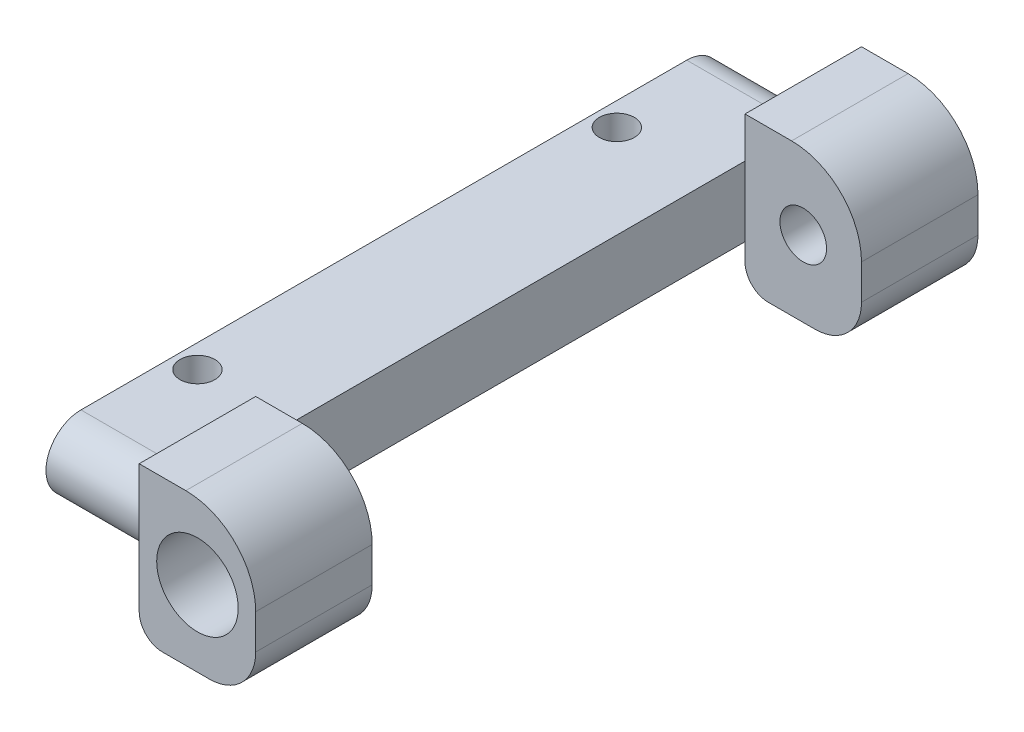
ISO-10303-21;
HEADER;
FILE_DESCRIPTION(('STEP AP214'),'2;1');
FILE_NAME('part.step','',(''),(''),'','','');
FILE_SCHEMA(('AUTOMOTIVE_DESIGN { 1 0 10303 214 1 1 1 1 }'));
ENDSEC;
DATA;
#1=APPLICATION_CONTEXT('core data for automotive mechanical design processes');
#2=APPLICATION_PROTOCOL_DEFINITION('international standard','automotive_design',2000,#1);
#3=PRODUCT_CONTEXT('',#1,'mechanical');
#4=PRODUCT('Part','Part','',(#3));
#5=PRODUCT_RELATED_PRODUCT_CATEGORY('part','',(#4));
#6=PRODUCT_DEFINITION_FORMATION('','',#4);
#7=PRODUCT_DEFINITION_CONTEXT('part definition',#1,'design');
#8=PRODUCT_DEFINITION('design','',#6,#7);
#9=PRODUCT_DEFINITION_SHAPE('','',#8);
#10=(LENGTH_UNIT() NAMED_UNIT(*) SI_UNIT(.MILLI.,.METRE.));
#11=(NAMED_UNIT(*) PLANE_ANGLE_UNIT() SI_UNIT($,.RADIAN.));
#12=(NAMED_UNIT(*) SI_UNIT($,.STERADIAN.) SOLID_ANGLE_UNIT());
#13=UNCERTAINTY_MEASURE_WITH_UNIT(LENGTH_MEASURE(1.E-05),#10,'distance_accuracy_value','');
#14=(GEOMETRIC_REPRESENTATION_CONTEXT(3) GLOBAL_UNCERTAINTY_ASSIGNED_CONTEXT((#13)) GLOBAL_UNIT_ASSIGNED_CONTEXT((#10,
#11,#12)) REPRESENTATION_CONTEXT('',''));
#15=CARTESIAN_POINT('',(0.,0.,0.));
#16=DIRECTION('',(0.,0.,1.));
#17=DIRECTION('',(1.,0.,0.));
#18=AXIS2_PLACEMENT_3D('',#15,#16,#17);
#19=CARTESIAN_POINT('',(10.,3.25,10.5));
#20=DIRECTION('',(0.,0.,1.));
#21=DIRECTION('',(1.,0.,0.));
#22=AXIS2_PLACEMENT_3D('',#19,#20,#21);
#23=PLANE('',#22);
#24=DIRECTION('',(-1.,0.,0.));
#25=VECTOR('',#24,1.);
#26=CARTESIAN_POINT('',(10.,-3.25,10.5));
#27=LINE('',#26,#25);
#28=CARTESIAN_POINT('',(8.,-3.25,10.5));
#29=VERTEX_POINT('',#28);
#30=CARTESIAN_POINT('',(6.,-3.25,10.5));
#31=VERTEX_POINT('',#30);
#32=EDGE_CURVE('E207',#29,#31,#27,.T.);
#33=ORIENTED_EDGE('',*,*,#32,.T.);
#34=CARTESIAN_POINT('',(6.,-2.25,10.5));
#35=DIRECTION('',(0.,0.,1.));
#36=DIRECTION('',(1.,0.,0.));
#37=AXIS2_PLACEMENT_3D('',#34,#35,#36);
#38=CIRCLE('',#37,1.);
#39=CARTESIAN_POINT('',(5.,-2.25,10.5));
#40=VERTEX_POINT('',#39);
#41=EDGE_CURVE('E302',#31,#40,#38,.F.);
#42=ORIENTED_EDGE('',*,*,#41,.T.);
#43=DIRECTION('',(0.,1.,0.));
#44=VECTOR('',#43,1.);
#45=CARTESIAN_POINT('',(5.,3.25,10.5));
#46=LINE('',#45,#44);
#47=CARTESIAN_POINT('',(5.,-1.5,10.5));
#48=VERTEX_POINT('',#47);
#49=EDGE_CURVE('E208',#40,#48,#46,.T.);
#50=ORIENTED_EDGE('',*,*,#49,.T.);
#51=CARTESIAN_POINT('',(5.,1.5,10.5));
#52=VERTEX_POINT('',#51);
#53=EDGE_CURVE('E211',#48,#52,#46,.T.);
#54=ORIENTED_EDGE('',*,*,#53,.T.);
#55=CARTESIAN_POINT('',(5.,3.25,10.5));
#56=VERTEX_POINT('',#55);
#57=EDGE_CURVE('E182',#52,#56,#46,.T.);
#58=ORIENTED_EDGE('',*,*,#57,.T.);
#59=DIRECTION('',(-1.,0.,0.));
#60=VECTOR('',#59,1.);
#61=CARTESIAN_POINT('',(10.,3.25,10.5));
#62=LINE('',#61,#60);
#63=CARTESIAN_POINT('',(7.,3.25,10.5));
#64=VERTEX_POINT('',#63);
#65=EDGE_CURVE('E223',#64,#56,#62,.T.);
#66=ORIENTED_EDGE('',*,*,#65,.F.);
#67=CARTESIAN_POINT('',(7.,0.25,10.5));
#68=DIRECTION('',(0.,0.,1.));
#69=DIRECTION('',(1.,0.,0.));
#70=AXIS2_PLACEMENT_3D('',#67,#68,#69);
#71=CIRCLE('',#70,3.);
#72=CARTESIAN_POINT('',(10.,0.25,10.5));
#73=VERTEX_POINT('',#72);
#74=EDGE_CURVE('E270',#64,#73,#71,.F.);
#75=ORIENTED_EDGE('',*,*,#74,.T.);
#76=DIRECTION('',(0.,1.,0.));
#77=VECTOR('',#76,1.);
#78=CARTESIAN_POINT('',(10.,3.25,10.5));
#79=LINE('',#78,#77);
#80=CARTESIAN_POINT('',(10.,-1.25,10.5));
#81=VERTEX_POINT('',#80);
#82=EDGE_CURVE('E201',#81,#73,#79,.T.);
#83=ORIENTED_EDGE('',*,*,#82,.F.);
#84=CARTESIAN_POINT('',(8.,-1.25,10.5));
#85=DIRECTION('',(0.,0.,1.));
#86=DIRECTION('',(1.,0.,0.));
#87=AXIS2_PLACEMENT_3D('',#84,#85,#86);
#88=CIRCLE('',#87,2.);
#89=EDGE_CURVE('E293',#81,#29,#88,.F.);
#90=ORIENTED_EDGE('',*,*,#89,.T.);
#91=EDGE_LOOP('',(#33,#42,#50,#54,#58,#66,#75,#83,#90));
#92=FACE_BOUND('',#91,.T.);
#93=CARTESIAN_POINT('',(7.5,0.,10.5));
#94=DIRECTION('',(0.,0.,-1.));
#95=DIRECTION('',(-1.,0.,0.));
#96=AXIS2_PLACEMENT_3D('',#93,#94,#95);
#97=CIRCLE('',#96,1.);
#98=CARTESIAN_POINT('',(6.5,0.,10.5));
#99=VERTEX_POINT('',#98);
#100=EDGE_CURVE('E347',#99,#99,#97,.T.);
#101=ORIENTED_EDGE('',*,*,#100,.F.);
#102=EDGE_LOOP('',(#101));
#103=FACE_BOUND('',#102,.T.);
#104=ADVANCED_FACE('F32',(#92,#103),#23,.F.);
#105=CARTESIAN_POINT('',(7.5,0.,13.));
#106=DIRECTION('',(0.,0.,1.));
#107=DIRECTION('',(-1.,0.,0.));
#108=AXIS2_PLACEMENT_3D('',#105,#106,#107);
#109=PLANE('',#108);
#110=CARTESIAN_POINT('',(7.5,0.,13.));
#111=DIRECTION('',(0.,0.,-1.));
#112=DIRECTION('',(-1.,0.,0.));
#113=AXIS2_PLACEMENT_3D('',#110,#111,#112);
#114=CIRCLE('',#113,1.75);
#115=CARTESIAN_POINT('',(5.75,0.,13.));
#116=VERTEX_POINT('',#115);
#117=EDGE_CURVE('E341',#116,#116,#114,.T.);
#118=ORIENTED_EDGE('',*,*,#117,.F.);
#119=EDGE_LOOP('',(#118));
#120=FACE_BOUND('',#119,.T.);
#121=CARTESIAN_POINT('',(7.5,0.,13.));
#122=DIRECTION('',(0.,0.,-1.));
#123=DIRECTION('',(-1.,0.,0.));
#124=AXIS2_PLACEMENT_3D('',#121,#122,#123);
#125=CIRCLE('',#124,1.);
#126=CARTESIAN_POINT('',(6.5,0.,13.));
#127=VERTEX_POINT('',#126);
#128=EDGE_CURVE('E350',#127,#127,#125,.T.);
#129=ORIENTED_EDGE('',*,*,#128,.T.);
#130=EDGE_LOOP('',(#129));
#131=FACE_BOUND('',#130,.T.);
#132=ADVANCED_FACE('F421',(#120,#131),#109,.T.);
#133=CARTESIAN_POINT('',(10.,3.25,15.5));
#134=DIRECTION('',(0.,0.,-1.));
#135=DIRECTION('',(-1.,0.,0.));
#136=AXIS2_PLACEMENT_3D('',#133,#134,#135);
#137=PLANE('',#136);
#138=DIRECTION('',(0.,-1.,0.));
#139=VECTOR('',#138,1.);
#140=CARTESIAN_POINT('',(5.,3.25,15.5));
#141=LINE('',#140,#139);
#142=CARTESIAN_POINT('',(5.,3.25,15.5));
#143=VERTEX_POINT('',#142);
#144=CARTESIAN_POINT('',(5.,-2.25,15.5));
#145=VERTEX_POINT('',#144);
#146=EDGE_CURVE('E204',#143,#145,#141,.T.);
#147=ORIENTED_EDGE('',*,*,#146,.T.);
#148=CARTESIAN_POINT('',(6.,-2.25,15.5));
#149=DIRECTION('',(0.,0.,-1.));
#150=DIRECTION('',(-1.,0.,0.));
#151=AXIS2_PLACEMENT_3D('',#148,#149,#150);
#152=CIRCLE('',#151,1.);
#153=CARTESIAN_POINT('',(6.,-3.25,15.5));
#154=VERTEX_POINT('',#153);
#155=EDGE_CURVE('E306',#145,#154,#152,.F.);
#156=ORIENTED_EDGE('',*,*,#155,.T.);
#157=DIRECTION('',(-1.,0.,0.));
#158=VECTOR('',#157,1.);
#159=CARTESIAN_POINT('',(10.,-3.25,15.5));
#160=LINE('',#159,#158);
#161=CARTESIAN_POINT('',(8.,-3.25,15.5));
#162=VERTEX_POINT('',#161);
#163=EDGE_CURVE('E218',#162,#154,#160,.T.);
#164=ORIENTED_EDGE('',*,*,#163,.F.);
#165=CARTESIAN_POINT('',(8.,-1.25,15.5));
#166=DIRECTION('',(0.,0.,-1.));
#167=DIRECTION('',(-1.,0.,0.));
#168=AXIS2_PLACEMENT_3D('',#165,#166,#167);
#169=CIRCLE('',#168,2.);
#170=CARTESIAN_POINT('',(10.,-1.25,15.5));
#171=VERTEX_POINT('',#170);
#172=EDGE_CURVE('E297',#162,#171,#169,.F.);
#173=ORIENTED_EDGE('',*,*,#172,.T.);
#174=DIRECTION('',(0.,-1.,0.));
#175=VECTOR('',#174,1.);
#176=CARTESIAN_POINT('',(10.,3.25,15.5));
#177=LINE('',#176,#175);
#178=CARTESIAN_POINT('',(10.,0.25,15.5));
#179=VERTEX_POINT('',#178);
#180=EDGE_CURVE('E203',#179,#171,#177,.T.);
#181=ORIENTED_EDGE('',*,*,#180,.F.);
#182=CARTESIAN_POINT('',(7.,0.25,15.5));
#183=DIRECTION('',(0.,0.,-1.));
#184=DIRECTION('',(-1.,0.,0.));
#185=AXIS2_PLACEMENT_3D('',#182,#183,#184);
#186=CIRCLE('',#185,3.);
#187=CARTESIAN_POINT('',(7.,3.25,15.5));
#188=VERTEX_POINT('',#187);
#189=EDGE_CURVE('E266',#179,#188,#186,.F.);
#190=ORIENTED_EDGE('',*,*,#189,.T.);
#191=DIRECTION('',(-1.,0.,0.));
#192=VECTOR('',#191,1.);
#193=CARTESIAN_POINT('',(10.,3.25,15.5));
#194=LINE('',#193,#192);
#195=EDGE_CURVE('E221',#188,#143,#194,.T.);
#196=ORIENTED_EDGE('',*,*,#195,.T.);
#197=EDGE_LOOP('',(#147,#156,#164,#173,#181,#190,#196));
#198=FACE_BOUND('',#197,.T.);
#199=CARTESIAN_POINT('',(7.5,0.,15.5));
#200=DIRECTION('',(0.,0.,-1.));
#201=DIRECTION('',(-1.,0.,0.));
#202=AXIS2_PLACEMENT_3D('',#199,#200,#201);
#203=CIRCLE('',#202,1.75);
#204=CARTESIAN_POINT('',(5.75,0.,15.5));
#205=VERTEX_POINT('',#204);
#206=EDGE_CURVE('E344',#205,#205,#203,.T.);
#207=ORIENTED_EDGE('',*,*,#206,.T.);
#208=EDGE_LOOP('',(#207));
#209=FACE_BOUND('',#208,.T.);
#210=ADVANCED_FACE('F427',(#198,#209),#137,.F.);
#211=CARTESIAN_POINT('',(5.,0.,13.));
#212=DIRECTION('',(1.,0.,0.));
#213=DIRECTION('',(0.,0.,-1.));
#214=AXIS2_PLACEMENT_3D('',#211,#212,#213);
#215=PLANE('',#214);
#216=DIRECTION('',(0.,0.,-1.));
#217=VECTOR('',#216,1.);
#218=CARTESIAN_POINT('',(5.,-1.5,13.));
#219=LINE('',#218,#217);
#220=CARTESIAN_POINT('',(5.,-1.5,-10.5));
#221=VERTEX_POINT('',#220);
#222=EDGE_CURVE('E235',#48,#221,#219,.T.);
#223=ORIENTED_EDGE('',*,*,#222,.T.);
#224=DIRECTION('',(0.,1.,0.));
#225=VECTOR('',#224,1.);
#226=CARTESIAN_POINT('',(5.,0.,-10.5));
#227=LINE('',#226,#225);
#228=CARTESIAN_POINT('',(5.,1.50000000000001,-10.5));
#229=VERTEX_POINT('',#228);
#230=EDGE_CURVE('E260',#221,#229,#227,.T.);
#231=ORIENTED_EDGE('',*,*,#230,.T.);
#232=DIRECTION('',(0.,0.,1.));
#233=VECTOR('',#232,1.);
#234=CARTESIAN_POINT('',(5.,1.5,13.));
#235=LINE('',#234,#233);
#236=EDGE_CURVE('E241',#229,#52,#235,.T.);
#237=ORIENTED_EDGE('',*,*,#236,.T.);
#238=ORIENTED_EDGE('',*,*,#53,.F.);
#239=EDGE_LOOP('',(#223,#231,#237,#238));
#240=FACE_BOUND('',#239,.T.);
#241=ADVANCED_FACE('F406',(#240),#215,.T.);
#242=CARTESIAN_POINT('',(5.,0.,13.));
#243=DIRECTION('',(-1.,0.,0.));
#244=DIRECTION('',(0.,0.,1.));
#245=AXIS2_PLACEMENT_3D('',#242,#243,#244);
#246=CYLINDRICAL_SURFACE('',#245,1.5);
#247=CARTESIAN_POINT('',(0.,0.,13.));
#248=DIRECTION('',(1.,0.,0.));
#249=DIRECTION('',(0.,0.,-1.));
#250=AXIS2_PLACEMENT_3D('',#247,#248,#249);
#251=CIRCLE('',#250,1.5);
#252=CARTESIAN_POINT('',(0.,1.5,13.));
#253=VERTEX_POINT('',#252);
#254=CARTESIAN_POINT('',(0.,-1.5,13.));
#255=VERTEX_POINT('',#254);
#256=EDGE_CURVE('E225',#253,#255,#251,.T.);
#257=ORIENTED_EDGE('',*,*,#256,.T.);
#258=DIRECTION('',(-1.,0.,0.));
#259=VECTOR('',#258,1.);
#260=CARTESIAN_POINT('',(5.,-1.5,13.));
#261=LINE('',#260,#259);
#262=CARTESIAN_POINT('',(5.,-1.5,13.));
#263=VERTEX_POINT('',#262);
#264=EDGE_CURVE('E257',#263,#255,#261,.T.);
#265=ORIENTED_EDGE('',*,*,#264,.F.);
#266=CARTESIAN_POINT('',(5.,0.,13.));
#267=DIRECTION('',(1.,0.,0.));
#268=DIRECTION('',(0.,0.,-1.));
#269=AXIS2_PLACEMENT_3D('',#266,#267,#268);
#270=CIRCLE('',#269,1.5);
#271=CARTESIAN_POINT('',(5.,1.5,13.));
#272=VERTEX_POINT('',#271);
#273=EDGE_CURVE('E226',#272,#263,#270,.T.);
#274=ORIENTED_EDGE('',*,*,#273,.F.);
#275=DIRECTION('',(-1.,0.,0.));
#276=VECTOR('',#275,1.);
#277=CARTESIAN_POINT('',(5.,1.5,13.));
#278=LINE('',#277,#276);
#279=EDGE_CURVE('E240',#272,#253,#278,.T.);
#280=ORIENTED_EDGE('',*,*,#279,.T.);
#281=EDGE_LOOP('',(#257,#265,#274,#280));
#282=FACE_BOUND('',#281,.T.);
#283=ADVANCED_FACE('F388',(#282),#246,.T.);
#284=CARTESIAN_POINT('',(5.,-1.5,13.));
#285=DIRECTION('',(0.,1.,0.));
#286=DIRECTION('',(0.,0.,1.));
#287=AXIS2_PLACEMENT_3D('',#284,#285,#286);
#288=PLANE('',#287);
#289=CARTESIAN_POINT('',(1.,-1.5,8.99999999999999));
#290=DIRECTION('',(0.,1.,0.));
#291=DIRECTION('',(0.,0.,1.));
#292=AXIS2_PLACEMENT_3D('',#289,#290,#291);
#293=CIRCLE('',#292,0.75);
#294=CARTESIAN_POINT('',(1.,-1.5,9.74999999999999));
#295=VERTEX_POINT('',#294);
#296=EDGE_CURVE('E361',#295,#295,#293,.T.);
#297=ORIENTED_EDGE('',*,*,#296,.T.);
#298=EDGE_LOOP('',(#297));
#299=FACE_BOUND('',#298,.T.);
#300=CARTESIAN_POINT('',(1.,-1.5,-9.));
#301=DIRECTION('',(0.,1.,0.));
#302=DIRECTION('',(0.,0.,1.));
#303=AXIS2_PLACEMENT_3D('',#300,#301,#302);
#304=CIRCLE('',#303,0.75);
#305=CARTESIAN_POINT('',(1.,-1.5,-8.25));
#306=VERTEX_POINT('',#305);
#307=EDGE_CURVE('E353',#306,#306,#304,.T.);
#308=ORIENTED_EDGE('',*,*,#307,.T.);
#309=EDGE_LOOP('',(#308));
#310=FACE_BOUND('',#309,.T.);
#311=DIRECTION('',(0.,0.,-1.));
#312=VECTOR('',#311,1.);
#313=CARTESIAN_POINT('',(0.,-1.5,13.));
#314=LINE('',#313,#312);
#315=CARTESIAN_POINT('',(0.,-1.5,-13.));
#316=VERTEX_POINT('',#315);
#317=EDGE_CURVE('E244',#255,#316,#314,.T.);
#318=ORIENTED_EDGE('',*,*,#317,.T.);
#319=DIRECTION('',(-1.,0.,0.));
#320=VECTOR('',#319,1.);
#321=CARTESIAN_POINT('',(5.,-1.5,-13.));
#322=LINE('',#321,#320);
#323=CARTESIAN_POINT('',(5.,-1.5,-13.));
#324=VERTEX_POINT('',#323);
#325=EDGE_CURVE('E254',#324,#316,#322,.T.);
#326=ORIENTED_EDGE('',*,*,#325,.F.);
#327=EDGE_CURVE('E229',#221,#324,#219,.T.);
#328=ORIENTED_EDGE('',*,*,#327,.F.);
#329=ORIENTED_EDGE('',*,*,#222,.F.);
#330=EDGE_CURVE('E231',#263,#48,#219,.T.);
#331=ORIENTED_EDGE('',*,*,#330,.F.);
#332=ORIENTED_EDGE('',*,*,#264,.T.);
#333=EDGE_LOOP('',(#318,#326,#328,#329,#331,#332));
#334=FACE_BOUND('',#333,.T.);
#335=ADVANCED_FACE('F393',(#299,#310,#334),#288,.F.);
#336=CARTESIAN_POINT('',(5.,0.,-13.));
#337=DIRECTION('',(-1.,0.,0.));
#338=DIRECTION('',(0.,0.,1.));
#339=AXIS2_PLACEMENT_3D('',#336,#337,#338);
#340=CYLINDRICAL_SURFACE('',#339,1.5);
#341=CARTESIAN_POINT('',(0.,0.,-13.));
#342=DIRECTION('',(1.,0.,0.));
#343=DIRECTION('',(0.,0.,-1.));
#344=AXIS2_PLACEMENT_3D('',#341,#342,#343);
#345=CIRCLE('',#344,1.5);
#346=CARTESIAN_POINT('',(0.,1.50000000000001,-13.));
#347=VERTEX_POINT('',#346);
#348=EDGE_CURVE('E246',#316,#347,#345,.T.);
#349=ORIENTED_EDGE('',*,*,#348,.T.);
#350=DIRECTION('',(-1.,0.,0.));
#351=VECTOR('',#350,1.);
#352=CARTESIAN_POINT('',(5.,1.50000000000001,-13.));
#353=LINE('',#352,#351);
#354=CARTESIAN_POINT('',(5.,1.50000000000001,-13.));
#355=VERTEX_POINT('',#354);
#356=EDGE_CURVE('E251',#355,#347,#353,.T.);
#357=ORIENTED_EDGE('',*,*,#356,.F.);
#358=CARTESIAN_POINT('',(5.,0.,-13.));
#359=DIRECTION('',(1.,0.,0.));
#360=DIRECTION('',(0.,0.,-1.));
#361=AXIS2_PLACEMENT_3D('',#358,#359,#360);
#362=CIRCLE('',#361,1.5);
#363=EDGE_CURVE('E234',#324,#355,#362,.T.);
#364=ORIENTED_EDGE('',*,*,#363,.F.);
#365=ORIENTED_EDGE('',*,*,#325,.T.);
#366=EDGE_LOOP('',(#349,#357,#364,#365));
#367=FACE_BOUND('',#366,.T.);
#368=ADVANCED_FACE('F375',(#367),#340,.T.);
#369=CARTESIAN_POINT('',(5.,1.5,13.));
#370=DIRECTION('',(0.,-1.,0.));
#371=DIRECTION('',(0.,0.,-1.));
#372=AXIS2_PLACEMENT_3D('',#369,#370,#371);
#373=PLANE('',#372);
#374=CARTESIAN_POINT('',(1.,1.5,8.99999999999999));
#375=DIRECTION('',(0.,1.,0.));
#376=DIRECTION('',(0.,0.,-1.));
#377=AXIS2_PLACEMENT_3D('',#374,#375,#376);
#378=CIRCLE('',#377,0.75);
#379=CARTESIAN_POINT('',(1.,1.5,8.24999999999999));
#380=VERTEX_POINT('',#379);
#381=EDGE_CURVE('E364',#380,#380,#378,.T.);
#382=ORIENTED_EDGE('',*,*,#381,.F.);
#383=EDGE_LOOP('',(#382));
#384=FACE_BOUND('',#383,.T.);
#385=CARTESIAN_POINT('',(1.,1.50000000000001,-9.));
#386=DIRECTION('',(0.,1.,0.));
#387=DIRECTION('',(0.,0.,1.));
#388=AXIS2_PLACEMENT_3D('',#385,#386,#387);
#389=CIRCLE('',#388,0.75);
#390=CARTESIAN_POINT('',(1.,1.50000000000001,-8.25));
#391=VERTEX_POINT('',#390);
#392=EDGE_CURVE('E358',#391,#391,#389,.T.);
#393=ORIENTED_EDGE('',*,*,#392,.F.);
#394=EDGE_LOOP('',(#393));
#395=FACE_BOUND('',#394,.T.);
#396=DIRECTION('',(0.,0.,1.));
#397=VECTOR('',#396,1.);
#398=CARTESIAN_POINT('',(0.,1.5,13.));
#399=LINE('',#398,#397);
#400=EDGE_CURVE('E230',#347,#253,#399,.T.);
#401=ORIENTED_EDGE('',*,*,#400,.T.);
#402=ORIENTED_EDGE('',*,*,#279,.F.);
#403=EDGE_CURVE('E237',#52,#272,#235,.T.);
#404=ORIENTED_EDGE('',*,*,#403,.F.);
#405=ORIENTED_EDGE('',*,*,#236,.F.);
#406=EDGE_CURVE('E238',#355,#229,#235,.T.);
#407=ORIENTED_EDGE('',*,*,#406,.F.);
#408=ORIENTED_EDGE('',*,*,#356,.T.);
#409=EDGE_LOOP('',(#401,#402,#404,#405,#407,#408));
#410=FACE_BOUND('',#409,.T.);
#411=ADVANCED_FACE('F371',(#384,#395,#410),#373,.F.);
#412=CARTESIAN_POINT('',(0.,0.,13.));
#413=DIRECTION('',(1.,0.,0.));
#414=DIRECTION('',(0.,0.,-1.));
#415=AXIS2_PLACEMENT_3D('',#412,#413,#414);
#416=PLANE('',#415);
#417=ORIENTED_EDGE('',*,*,#256,.F.);
#418=ORIENTED_EDGE('',*,*,#400,.F.);
#419=ORIENTED_EDGE('',*,*,#348,.F.);
#420=ORIENTED_EDGE('',*,*,#317,.F.);
#421=EDGE_LOOP('',(#417,#418,#419,#420));
#422=FACE_BOUND('',#421,.T.);
#423=ADVANCED_FACE('F374',(#422),#416,.F.);
#424=CARTESIAN_POINT('',(5.,0.,0.));
#425=DIRECTION('',(1.,0.,0.));
#426=DIRECTION('',(0.,0.,-1.));
#427=AXIS2_PLACEMENT_3D('',#424,#425,#426);
#428=PLANE('',#427);
#429=ORIENTED_EDGE('',*,*,#49,.F.);
#430=DIRECTION('',(0.,0.,-1.));
#431=VECTOR('',#430,1.);
#432=CARTESIAN_POINT('',(5.,-2.25,0.));
#433=LINE('',#432,#431);
#434=EDGE_CURVE('E304',#40,#145,#433,.F.);
#435=ORIENTED_EDGE('',*,*,#434,.T.);
#436=ORIENTED_EDGE('',*,*,#146,.F.);
#437=DIRECTION('',(0.,0.,1.));
#438=VECTOR('',#437,1.);
#439=CARTESIAN_POINT('',(5.,3.25,15.5));
#440=LINE('',#439,#438);
#441=EDGE_CURVE('E210',#56,#143,#440,.T.);
#442=ORIENTED_EDGE('',*,*,#441,.F.);
#443=ORIENTED_EDGE('',*,*,#57,.F.);
#444=ORIENTED_EDGE('',*,*,#403,.T.);
#445=ORIENTED_EDGE('',*,*,#273,.T.);
#446=ORIENTED_EDGE('',*,*,#330,.T.);
#447=EDGE_LOOP('',(#429,#435,#436,#442,#443,#444,#445,#446));
#448=FACE_BOUND('',#447,.T.);
#449=ADVANCED_FACE('F397',(#448),#428,.F.);
#450=CARTESIAN_POINT('',(10.,3.25,15.5));
#451=DIRECTION('',(0.,-1.,0.));
#452=DIRECTION('',(0.,0.,-1.));
#453=AXIS2_PLACEMENT_3D('',#450,#451,#452);
#454=PLANE('',#453);
#455=ORIENTED_EDGE('',*,*,#195,.F.);
#456=DIRECTION('',(0.,0.,1.));
#457=VECTOR('',#456,1.);
#458=CARTESIAN_POINT('',(7.,3.25,10.5));
#459=LINE('',#458,#457);
#460=EDGE_CURVE('E268',#188,#64,#459,.F.);
#461=ORIENTED_EDGE('',*,*,#460,.T.);
#462=ORIENTED_EDGE('',*,*,#65,.T.);
#463=ORIENTED_EDGE('',*,*,#441,.T.);
#464=EDGE_LOOP('',(#455,#461,#462,#463));
#465=FACE_BOUND('',#464,.T.);
#466=ADVANCED_FACE('F433',(#465),#454,.F.);
#467=CARTESIAN_POINT('',(10.,-3.25,15.5));
#468=DIRECTION('',(0.,1.,0.));
#469=DIRECTION('',(0.,0.,1.));
#470=AXIS2_PLACEMENT_3D('',#467,#468,#469);
#471=PLANE('',#470);
#472=ORIENTED_EDGE('',*,*,#163,.T.);
#473=DIRECTION('',(0.,0.,-1.));
#474=VECTOR('',#473,1.);
#475=CARTESIAN_POINT('',(6.,-3.25,15.5));
#476=LINE('',#475,#474);
#477=EDGE_CURVE('E299',#154,#31,#476,.T.);
#478=ORIENTED_EDGE('',*,*,#477,.T.);
#479=ORIENTED_EDGE('',*,*,#32,.F.);
#480=DIRECTION('',(0.,0.,-1.));
#481=VECTOR('',#480,1.);
#482=CARTESIAN_POINT('',(8.,-3.25,15.5));
#483=LINE('',#482,#481);
#484=EDGE_CURVE('E295',#29,#162,#483,.F.);
#485=ORIENTED_EDGE('',*,*,#484,.T.);
#486=EDGE_LOOP('',(#472,#478,#479,#485));
#487=FACE_BOUND('',#486,.T.);
#488=ADVANCED_FACE('F445',(#487),#471,.F.);
#489=CARTESIAN_POINT('',(10.,0.,0.));
#490=DIRECTION('',(1.,0.,0.));
#491=DIRECTION('',(0.,0.,-1.));
#492=AXIS2_PLACEMENT_3D('',#489,#490,#491);
#493=PLANE('',#492);
#494=ORIENTED_EDGE('',*,*,#180,.T.);
#495=DIRECTION('',(0.,0.,-1.));
#496=VECTOR('',#495,1.);
#497=CARTESIAN_POINT('',(10.,-1.25,10.5));
#498=LINE('',#497,#496);
#499=EDGE_CURVE('E290',#171,#81,#498,.T.);
#500=ORIENTED_EDGE('',*,*,#499,.T.);
#501=ORIENTED_EDGE('',*,*,#82,.T.);
#502=DIRECTION('',(0.,0.,1.));
#503=VECTOR('',#502,1.);
#504=CARTESIAN_POINT('',(10.,0.25,15.5));
#505=LINE('',#504,#503);
#506=EDGE_CURVE('E263',#73,#179,#505,.T.);
#507=ORIENTED_EDGE('',*,*,#506,.T.);
#508=EDGE_LOOP('',(#494,#500,#501,#507));
#509=FACE_BOUND('',#508,.T.);
#510=ADVANCED_FACE('F449',(#509),#493,.T.);
#511=CARTESIAN_POINT('',(5.,0.,0.));
#512=DIRECTION('',(-1.,0.,0.));
#513=DIRECTION('',(0.,0.,1.));
#514=AXIS2_PLACEMENT_3D('',#511,#512,#513);
#515=PLANE('',#514);
#516=DIRECTION('',(0.,1.,0.));
#517=VECTOR('',#516,1.);
#518=CARTESIAN_POINT('',(5.,3.25,-15.5));
#519=LINE('',#518,#517);
#520=CARTESIAN_POINT('',(5.,-2.25,-15.5));
#521=VERTEX_POINT('',#520);
#522=CARTESIAN_POINT('',(5.,3.25,-15.5));
#523=VERTEX_POINT('',#522);
#524=EDGE_CURVE('E165',#521,#523,#519,.T.);
#525=ORIENTED_EDGE('',*,*,#524,.F.);
#526=DIRECTION('',(0.,0.,-1.));
#527=VECTOR('',#526,1.);
#528=CARTESIAN_POINT('',(5.,-2.25,-10.5));
#529=LINE('',#528,#527);
#530=CARTESIAN_POINT('',(5.,-2.25,-10.5));
#531=VERTEX_POINT('',#530);
#532=EDGE_CURVE('E40',#521,#531,#529,.F.);
#533=ORIENTED_EDGE('',*,*,#532,.T.);
#534=DIRECTION('',(0.,-1.,0.));
#535=VECTOR('',#534,1.);
#536=CARTESIAN_POINT('',(5.,3.25,-10.5));
#537=LINE('',#536,#535);
#538=EDGE_CURVE('E188',#221,#531,#537,.T.);
#539=ORIENTED_EDGE('',*,*,#538,.F.);
#540=ORIENTED_EDGE('',*,*,#327,.T.);
#541=ORIENTED_EDGE('',*,*,#363,.T.);
#542=ORIENTED_EDGE('',*,*,#406,.T.);
#543=CARTESIAN_POINT('',(5.,3.25,-10.5));
#544=VERTEX_POINT('',#543);
#545=EDGE_CURVE('E187',#544,#229,#537,.T.);
#546=ORIENTED_EDGE('',*,*,#545,.F.);
#547=DIRECTION('',(0.,0.,1.));
#548=VECTOR('',#547,1.);
#549=CARTESIAN_POINT('',(5.,3.25,-15.5));
#550=LINE('',#549,#548);
#551=EDGE_CURVE('E172',#523,#544,#550,.T.);
#552=ORIENTED_EDGE('',*,*,#551,.F.);
#553=EDGE_LOOP('',(#525,#533,#539,#540,#541,#542,#546,#552));
#554=FACE_BOUND('',#553,.T.);
#555=ADVANCED_FACE('F185',(#554),#515,.T.);
#556=CARTESIAN_POINT('',(10.,3.25,-15.5));
#557=DIRECTION('',(0.,0.,1.));
#558=DIRECTION('',(1.,0.,0.));
#559=AXIS2_PLACEMENT_3D('',#556,#557,#558);
#560=PLANE('',#559);
#561=CARTESIAN_POINT('',(7.5,0.,-15.5));
#562=DIRECTION('',(0.,0.,-1.));
#563=DIRECTION('',(-1.,0.,0.));
#564=AXIS2_PLACEMENT_3D('',#561,#562,#563);
#565=CIRCLE('',#564,1.75);
#566=CARTESIAN_POINT('',(5.75,0.,-15.5));
#567=VERTEX_POINT('',#566);
#568=EDGE_CURVE('E332',#567,#567,#565,.T.);
#569=ORIENTED_EDGE('',*,*,#568,.F.);
#570=EDGE_LOOP('',(#569));
#571=FACE_BOUND('',#570,.T.);
#572=DIRECTION('',(-1.,0.,0.));
#573=VECTOR('',#572,1.);
#574=CARTESIAN_POINT('',(10.,-3.25,-15.5));
#575=LINE('',#574,#573);
#576=CARTESIAN_POINT('',(8.,-3.25,-15.5));
#577=VERTEX_POINT('',#576);
#578=CARTESIAN_POINT('',(6.,-3.25,-15.5));
#579=VERTEX_POINT('',#578);
#580=EDGE_CURVE('E194',#577,#579,#575,.T.);
#581=ORIENTED_EDGE('',*,*,#580,.T.);
#582=CARTESIAN_POINT('',(6.,-2.25,-15.5));
#583=DIRECTION('',(0.,0.,1.));
#584=DIRECTION('',(1.,0.,0.));
#585=AXIS2_PLACEMENT_3D('',#582,#583,#584);
#586=CIRCLE('',#585,1.);
#587=EDGE_CURVE('E54',#579,#521,#586,.F.);
#588=ORIENTED_EDGE('',*,*,#587,.T.);
#589=ORIENTED_EDGE('',*,*,#524,.T.);
#590=DIRECTION('',(-1.,0.,0.));
#591=VECTOR('',#590,1.);
#592=CARTESIAN_POINT('',(10.,3.25,-15.5));
#593=LINE('',#592,#591);
#594=CARTESIAN_POINT('',(7.,3.25,-15.5));
#595=VERTEX_POINT('',#594);
#596=EDGE_CURVE('E169',#595,#523,#593,.T.);
#597=ORIENTED_EDGE('',*,*,#596,.F.);
#598=CARTESIAN_POINT('',(7.,0.25,-15.5));
#599=DIRECTION('',(0.,0.,1.));
#600=DIRECTION('',(1.,0.,0.));
#601=AXIS2_PLACEMENT_3D('',#598,#599,#600);
#602=CIRCLE('',#601,3.);
#603=CARTESIAN_POINT('',(10.,0.25,-15.5));
#604=VERTEX_POINT('',#603);
#605=EDGE_CURVE('E279',#595,#604,#602,.F.);
#606=ORIENTED_EDGE('',*,*,#605,.T.);
#607=DIRECTION('',(0.,1.,0.));
#608=VECTOR('',#607,1.);
#609=CARTESIAN_POINT('',(10.,3.25,-15.5));
#610=LINE('',#609,#608);
#611=CARTESIAN_POINT('',(10.,-1.25,-15.5));
#612=VERTEX_POINT('',#611);
#613=EDGE_CURVE('E193',#612,#604,#610,.T.);
#614=ORIENTED_EDGE('',*,*,#613,.F.);
#615=CARTESIAN_POINT('',(8.,-1.25,-15.5));
#616=DIRECTION('',(0.,0.,1.));
#617=DIRECTION('',(1.,0.,0.));
#618=AXIS2_PLACEMENT_3D('',#615,#616,#617);
#619=CIRCLE('',#618,2.);
#620=EDGE_CURVE('E284',#612,#577,#619,.F.);
#621=ORIENTED_EDGE('',*,*,#620,.T.);
#622=EDGE_LOOP('',(#581,#588,#589,#597,#606,#614,#621));
#623=FACE_BOUND('',#622,.T.);
#624=ADVANCED_FACE('F167',(#571,#623),#560,.F.);
#625=CARTESIAN_POINT('',(10.,3.25,-15.5));
#626=DIRECTION('',(0.,-1.,0.));
#627=DIRECTION('',(0.,0.,-1.));
#628=AXIS2_PLACEMENT_3D('',#625,#626,#627);
#629=PLANE('',#628);
#630=DIRECTION('',(-1.,0.,0.));
#631=VECTOR('',#630,1.);
#632=CARTESIAN_POINT('',(10.,3.25,-10.5));
#633=LINE('',#632,#631);
#634=CARTESIAN_POINT('',(7.,3.25,-10.5));
#635=VERTEX_POINT('',#634);
#636=EDGE_CURVE('E183',#635,#544,#633,.T.);
#637=ORIENTED_EDGE('',*,*,#636,.F.);
#638=DIRECTION('',(0.,0.,1.));
#639=VECTOR('',#638,1.);
#640=CARTESIAN_POINT('',(7.,3.25,-15.5));
#641=LINE('',#640,#639);
#642=EDGE_CURVE('E181',#635,#595,#641,.F.);
#643=ORIENTED_EDGE('',*,*,#642,.T.);
#644=ORIENTED_EDGE('',*,*,#596,.T.);
#645=ORIENTED_EDGE('',*,*,#551,.T.);
#646=EDGE_LOOP('',(#637,#643,#644,#645));
#647=FACE_BOUND('',#646,.T.);
#648=ADVANCED_FACE('F178',(#647),#629,.F.);
#649=CARTESIAN_POINT('',(10.,3.25,-10.5));
#650=DIRECTION('',(0.,0.,-1.));
#651=DIRECTION('',(-1.,0.,0.));
#652=AXIS2_PLACEMENT_3D('',#649,#650,#651);
#653=PLANE('',#652);
#654=CARTESIAN_POINT('',(7.5,0.,-10.5));
#655=DIRECTION('',(0.,0.,-1.));
#656=DIRECTION('',(-1.,0.,0.));
#657=AXIS2_PLACEMENT_3D('',#654,#655,#656);
#658=CIRCLE('',#657,1.);
#659=CARTESIAN_POINT('',(6.5,0.,-10.5));
#660=VERTEX_POINT('',#659);
#661=EDGE_CURVE('E335',#660,#660,#658,.T.);
#662=ORIENTED_EDGE('',*,*,#661,.T.);
#663=EDGE_LOOP('',(#662));
#664=FACE_BOUND('',#663,.T.);
#665=ORIENTED_EDGE('',*,*,#538,.T.);
#666=CARTESIAN_POINT('',(6.,-2.25,-10.5));
#667=DIRECTION('',(0.,0.,-1.));
#668=DIRECTION('',(-1.,0.,0.));
#669=AXIS2_PLACEMENT_3D('',#666,#667,#668);
#670=CIRCLE('',#669,1.);
#671=CARTESIAN_POINT('',(6.,-3.25,-10.5));
#672=VERTEX_POINT('',#671);
#673=EDGE_CURVE('E11',#531,#672,#670,.F.);
#674=ORIENTED_EDGE('',*,*,#673,.T.);
#675=DIRECTION('',(-1.,0.,0.));
#676=VECTOR('',#675,1.);
#677=CARTESIAN_POINT('',(10.,-3.25,-10.5));
#678=LINE('',#677,#676);
#679=CARTESIAN_POINT('',(8.,-3.25,-10.5));
#680=VERTEX_POINT('',#679);
#681=EDGE_CURVE('E196',#680,#672,#678,.T.);
#682=ORIENTED_EDGE('',*,*,#681,.F.);
#683=CARTESIAN_POINT('',(8.,-1.25,-10.5));
#684=DIRECTION('',(0.,0.,-1.));
#685=DIRECTION('',(-1.,0.,0.));
#686=AXIS2_PLACEMENT_3D('',#683,#684,#685);
#687=CIRCLE('',#686,2.);
#688=CARTESIAN_POINT('',(10.,-1.25,-10.5));
#689=VERTEX_POINT('',#688);
#690=EDGE_CURVE('E288',#680,#689,#687,.F.);
#691=ORIENTED_EDGE('',*,*,#690,.T.);
#692=DIRECTION('',(0.,-1.,0.));
#693=VECTOR('',#692,1.);
#694=CARTESIAN_POINT('',(10.,3.25,-10.5));
#695=LINE('',#694,#693);
#696=CARTESIAN_POINT('',(10.,0.25,-10.5));
#697=VERTEX_POINT('',#696);
#698=EDGE_CURVE('E197',#697,#689,#695,.T.);
#699=ORIENTED_EDGE('',*,*,#698,.F.);
#700=CARTESIAN_POINT('',(7.,0.25,-10.5));
#701=DIRECTION('',(0.,0.,-1.));
#702=DIRECTION('',(-1.,0.,0.));
#703=AXIS2_PLACEMENT_3D('',#700,#701,#702);
#704=CIRCLE('',#703,3.);
#705=EDGE_CURVE('E276',#697,#635,#704,.F.);
#706=ORIENTED_EDGE('',*,*,#705,.T.);
#707=ORIENTED_EDGE('',*,*,#636,.T.);
#708=ORIENTED_EDGE('',*,*,#545,.T.);
#709=ORIENTED_EDGE('',*,*,#230,.F.);
#710=EDGE_LOOP('',(#665,#674,#682,#691,#699,#706,#707,#708,#709));
#711=FACE_BOUND('',#710,.T.);
#712=ADVANCED_FACE('F493',(#664,#711),#653,.F.);
#713=CARTESIAN_POINT('',(10.,-3.25,-15.5));
#714=DIRECTION('',(0.,1.,0.));
#715=DIRECTION('',(0.,0.,1.));
#716=AXIS2_PLACEMENT_3D('',#713,#714,#715);
#717=PLANE('',#716);
#718=ORIENTED_EDGE('',*,*,#681,.T.);
#719=DIRECTION('',(0.,0.,-1.));
#720=VECTOR('',#719,1.);
#721=CARTESIAN_POINT('',(6.,-3.25,-15.5));
#722=LINE('',#721,#720);
#723=EDGE_CURVE('E308',#672,#579,#722,.T.);
#724=ORIENTED_EDGE('',*,*,#723,.T.);
#725=ORIENTED_EDGE('',*,*,#580,.F.);
#726=DIRECTION('',(0.,0.,-1.));
#727=VECTOR('',#726,1.);
#728=CARTESIAN_POINT('',(8.,-3.25,-15.5));
#729=LINE('',#728,#727);
#730=EDGE_CURVE('E286',#577,#680,#729,.F.);
#731=ORIENTED_EDGE('',*,*,#730,.T.);
#732=EDGE_LOOP('',(#718,#724,#725,#731));
#733=FACE_BOUND('',#732,.T.);
#734=ADVANCED_FACE('F314',(#733),#717,.F.);
#735=CARTESIAN_POINT('',(10.,0.,0.));
#736=DIRECTION('',(-1.,0.,0.));
#737=DIRECTION('',(0.,0.,1.));
#738=AXIS2_PLACEMENT_3D('',#735,#736,#737);
#739=PLANE('',#738);
#740=ORIENTED_EDGE('',*,*,#698,.T.);
#741=DIRECTION('',(0.,0.,-1.));
#742=VECTOR('',#741,1.);
#743=CARTESIAN_POINT('',(10.,-1.25,0.));
#744=LINE('',#743,#742);
#745=EDGE_CURVE('E281',#689,#612,#744,.T.);
#746=ORIENTED_EDGE('',*,*,#745,.T.);
#747=ORIENTED_EDGE('',*,*,#613,.T.);
#748=DIRECTION('',(0.,0.,1.));
#749=VECTOR('',#748,1.);
#750=CARTESIAN_POINT('',(10.,0.25,0.));
#751=LINE('',#750,#749);
#752=EDGE_CURVE('E273',#604,#697,#751,.T.);
#753=ORIENTED_EDGE('',*,*,#752,.T.);
#754=EDGE_LOOP('',(#740,#746,#747,#753));
#755=FACE_BOUND('',#754,.T.);
#756=ADVANCED_FACE('F326',(#755),#739,.F.);
#757=CARTESIAN_POINT('',(7.,0.25,0.));
#758=DIRECTION('',(0.,0.,-1.));
#759=DIRECTION('',(-1.,0.,0.));
#760=AXIS2_PLACEMENT_3D('',#757,#758,#759);
#761=CYLINDRICAL_SURFACE('',#760,3.);
#762=ORIENTED_EDGE('',*,*,#74,.F.);
#763=ORIENTED_EDGE('',*,*,#460,.F.);
#764=ORIENTED_EDGE('',*,*,#189,.F.);
#765=ORIENTED_EDGE('',*,*,#506,.F.);
#766=EDGE_LOOP('',(#762,#763,#764,#765));
#767=FACE_BOUND('',#766,.T.);
#768=ADVANCED_FACE('F488',(#767),#761,.T.);
#769=CARTESIAN_POINT('',(7.,0.25,0.));
#770=DIRECTION('',(0.,0.,1.));
#771=DIRECTION('',(1.,0.,0.));
#772=AXIS2_PLACEMENT_3D('',#769,#770,#771);
#773=CYLINDRICAL_SURFACE('',#772,3.);
#774=ORIENTED_EDGE('',*,*,#605,.F.);
#775=ORIENTED_EDGE('',*,*,#642,.F.);
#776=ORIENTED_EDGE('',*,*,#705,.F.);
#777=ORIENTED_EDGE('',*,*,#752,.F.);
#778=EDGE_LOOP('',(#774,#775,#776,#777));
#779=FACE_BOUND('',#778,.T.);
#780=ADVANCED_FACE('F536',(#779),#773,.T.);
#781=CARTESIAN_POINT('',(8.,-1.25,0.));
#782=DIRECTION('',(0.,0.,-1.));
#783=DIRECTION('',(-1.,0.,0.));
#784=AXIS2_PLACEMENT_3D('',#781,#782,#783);
#785=CYLINDRICAL_SURFACE('',#784,2.);
#786=ORIENTED_EDGE('',*,*,#690,.F.);
#787=ORIENTED_EDGE('',*,*,#730,.F.);
#788=ORIENTED_EDGE('',*,*,#620,.F.);
#789=ORIENTED_EDGE('',*,*,#745,.F.);
#790=EDGE_LOOP('',(#786,#787,#788,#789));
#791=FACE_BOUND('',#790,.T.);
#792=ADVANCED_FACE('F323',(#791),#785,.T.);
#793=CARTESIAN_POINT('',(8.,-1.25,0.));
#794=DIRECTION('',(0.,0.,1.));
#795=DIRECTION('',(1.,0.,0.));
#796=AXIS2_PLACEMENT_3D('',#793,#794,#795);
#797=CYLINDRICAL_SURFACE('',#796,2.);
#798=ORIENTED_EDGE('',*,*,#172,.F.);
#799=ORIENTED_EDGE('',*,*,#484,.F.);
#800=ORIENTED_EDGE('',*,*,#89,.F.);
#801=ORIENTED_EDGE('',*,*,#499,.F.);
#802=EDGE_LOOP('',(#798,#799,#800,#801));
#803=FACE_BOUND('',#802,.T.);
#804=ADVANCED_FACE('F550',(#803),#797,.T.);
#805=CARTESIAN_POINT('',(6.,-2.25,15.5));
#806=DIRECTION('',(0.,0.,-1.));
#807=DIRECTION('',(-1.,0.,0.));
#808=AXIS2_PLACEMENT_3D('',#805,#806,#807);
#809=CYLINDRICAL_SURFACE('',#808,1.);
#810=ORIENTED_EDGE('',*,*,#155,.F.);
#811=ORIENTED_EDGE('',*,*,#434,.F.);
#812=ORIENTED_EDGE('',*,*,#41,.F.);
#813=ORIENTED_EDGE('',*,*,#477,.F.);
#814=EDGE_LOOP('',(#810,#811,#812,#813));
#815=FACE_BOUND('',#814,.T.);
#816=ADVANCED_FACE('F557',(#815),#809,.T.);
#817=CARTESIAN_POINT('',(6.,-2.25,-15.5));
#818=DIRECTION('',(0.,0.,1.));
#819=DIRECTION('',(1.,0.,0.));
#820=AXIS2_PLACEMENT_3D('',#817,#818,#819);
#821=CYLINDRICAL_SURFACE('',#820,1.);
#822=ORIENTED_EDGE('',*,*,#673,.F.);
#823=ORIENTED_EDGE('',*,*,#532,.F.);
#824=ORIENTED_EDGE('',*,*,#587,.F.);
#825=ORIENTED_EDGE('',*,*,#723,.F.);
#826=EDGE_LOOP('',(#822,#823,#824,#825));
#827=FACE_BOUND('',#826,.T.);
#828=ADVANCED_FACE('F34',(#827),#821,.T.);
#829=CARTESIAN_POINT('',(7.5,0.,-13.));
#830=DIRECTION('',(0.,0.,-1.));
#831=DIRECTION('',(-1.,0.,0.));
#832=AXIS2_PLACEMENT_3D('',#829,#830,#831);
#833=CYLINDRICAL_SURFACE('',#832,1.75);
#834=CARTESIAN_POINT('',(7.5,0.,-13.));
#835=DIRECTION('',(0.,0.,-1.));
#836=DIRECTION('',(-1.,0.,0.));
#837=AXIS2_PLACEMENT_3D('',#834,#835,#836);
#838=CIRCLE('',#837,1.75);
#839=CARTESIAN_POINT('',(5.75,0.,-13.));
#840=VERTEX_POINT('',#839);
#841=EDGE_CURVE('E173',#840,#840,#838,.T.);
#842=ORIENTED_EDGE('',*,*,#841,.F.);
#843=EDGE_LOOP('',(#842));
#844=FACE_BOUND('',#843,.T.);
#845=ORIENTED_EDGE('',*,*,#568,.T.);
#846=EDGE_LOOP('',(#845));
#847=FACE_BOUND('',#846,.T.);
#848=ADVANCED_FACE('F481',(#844,#847),#833,.F.);
#849=CARTESIAN_POINT('',(7.5,0.,-13.));
#850=DIRECTION('',(0.,0.,-1.));
#851=DIRECTION('',(-1.,0.,0.));
#852=AXIS2_PLACEMENT_3D('',#849,#850,#851);
#853=PLANE('',#852);
#854=CARTESIAN_POINT('',(7.5,0.,-13.));
#855=DIRECTION('',(0.,0.,-1.));
#856=DIRECTION('',(-1.,0.,0.));
#857=AXIS2_PLACEMENT_3D('',#854,#855,#856);
#858=CIRCLE('',#857,1.);
#859=CARTESIAN_POINT('',(6.5,0.,-13.));
#860=VERTEX_POINT('',#859);
#861=EDGE_CURVE('E338',#860,#860,#858,.T.);
#862=ORIENTED_EDGE('',*,*,#861,.F.);
#863=EDGE_LOOP('',(#862));
#864=FACE_BOUND('',#863,.T.);
#865=ORIENTED_EDGE('',*,*,#841,.T.);
#866=EDGE_LOOP('',(#865));
#867=FACE_BOUND('',#866,.T.);
#868=ADVANCED_FACE('F475',(#864,#867),#853,.T.);
#869=CARTESIAN_POINT('',(7.5,0.,-10.5));
#870=DIRECTION('',(0.,0.,-1.));
#871=DIRECTION('',(-1.,0.,0.));
#872=AXIS2_PLACEMENT_3D('',#869,#870,#871);
#873=CYLINDRICAL_SURFACE('',#872,1.);
#874=ORIENTED_EDGE('',*,*,#661,.F.);
#875=EDGE_LOOP('',(#874));
#876=FACE_BOUND('',#875,.T.);
#877=ORIENTED_EDGE('',*,*,#861,.T.);
#878=EDGE_LOOP('',(#877));
#879=FACE_BOUND('',#878,.T.);
#880=ADVANCED_FACE('F465',(#876,#879),#873,.F.);
#881=CARTESIAN_POINT('',(7.5,0.,13.));
#882=DIRECTION('',(0.,0.,1.));
#883=DIRECTION('',(1.,0.,0.));
#884=AXIS2_PLACEMENT_3D('',#881,#882,#883);
#885=CYLINDRICAL_SURFACE('',#884,1.75);
#886=ORIENTED_EDGE('',*,*,#117,.T.);
#887=EDGE_LOOP('',(#886));
#888=FACE_BOUND('',#887,.T.);
#889=ORIENTED_EDGE('',*,*,#206,.F.);
#890=EDGE_LOOP('',(#889));
#891=FACE_BOUND('',#890,.T.);
#892=ADVANCED_FACE('F462',(#888,#891),#885,.F.);
#893=CARTESIAN_POINT('',(7.5,0.,10.5));
#894=DIRECTION('',(0.,0.,1.));
#895=DIRECTION('',(1.,0.,0.));
#896=AXIS2_PLACEMENT_3D('',#893,#894,#895);
#897=CYLINDRICAL_SURFACE('',#896,1.);
#898=ORIENTED_EDGE('',*,*,#100,.T.);
#899=EDGE_LOOP('',(#898));
#900=FACE_BOUND('',#899,.T.);
#901=ORIENTED_EDGE('',*,*,#128,.F.);
#902=EDGE_LOOP('',(#901));
#903=FACE_BOUND('',#902,.T.);
#904=ADVANCED_FACE('F464',(#900,#903),#897,.F.);
#905=CARTESIAN_POINT('',(1.,-3.49999999999999,-9.));
#906=DIRECTION('',(0.,1.,0.));
#907=DIRECTION('',(0.,0.,1.));
#908=AXIS2_PLACEMENT_3D('',#905,#906,#907);
#909=CYLINDRICAL_SURFACE('',#908,0.75);
#910=ORIENTED_EDGE('',*,*,#392,.T.);
#911=EDGE_LOOP('',(#910));
#912=FACE_BOUND('',#911,.T.);
#913=ORIENTED_EDGE('',*,*,#307,.F.);
#914=EDGE_LOOP('',(#913));
#915=FACE_BOUND('',#914,.T.);
#916=ADVANCED_FACE('F472',(#912,#915),#909,.F.);
#917=CARTESIAN_POINT('',(1.,-3.5,8.99999999999999));
#918=DIRECTION('',(0.,1.,0.));
#919=DIRECTION('',(0.,0.,1.));
#920=AXIS2_PLACEMENT_3D('',#917,#918,#919);
#921=CYLINDRICAL_SURFACE('',#920,0.75);
#922=ORIENTED_EDGE('',*,*,#381,.T.);
#923=EDGE_LOOP('',(#922));
#924=FACE_BOUND('',#923,.T.);
#925=ORIENTED_EDGE('',*,*,#296,.F.);
#926=EDGE_LOOP('',(#925));
#927=FACE_BOUND('',#926,.T.);
#928=ADVANCED_FACE('F368',(#924,#927),#921,.F.);
#929=CLOSED_SHELL('',(#104,#132,#210,#241,#283,#335,#368,#411,#423,#449,#466,#488,#510,#555,
#624,#648,#712,#734,#756,#768,#780,#792,#804,#816,#828,#848,#868,#880,#892,#904,#916,#928));
#930=MANIFOLD_SOLID_BREP('B2',#929);
#931=ADVANCED_BREP_SHAPE_REPRESENTATION('',(#18,#930),#14);
#932=SHAPE_DEFINITION_REPRESENTATION(#9,#931);
ENDSEC;
END-ISO-10303-21;
